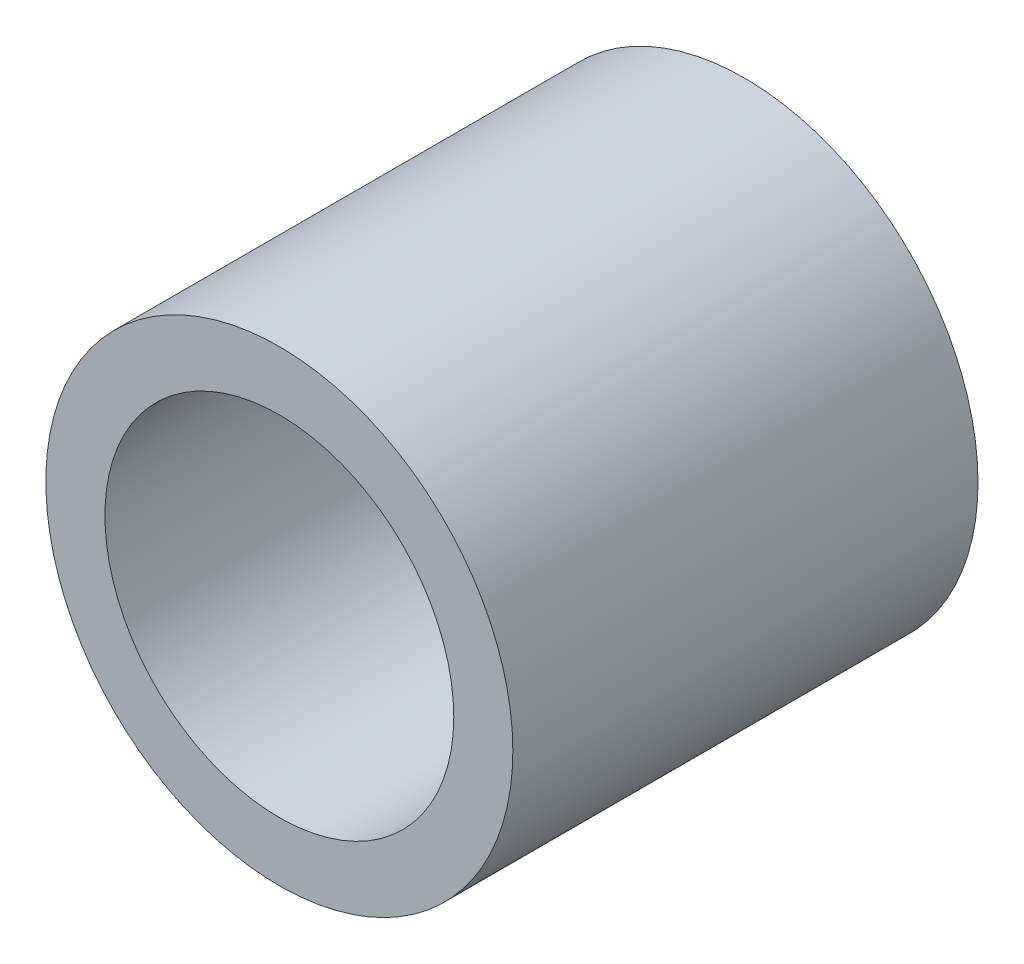
ISO-10303-21;
HEADER;
FILE_DESCRIPTION(('STEP AP214'),'2;1');
FILE_NAME('part.step','',(''),(''),'','','');
FILE_SCHEMA(('AUTOMOTIVE_DESIGN { 1 0 10303 214 1 1 1 1 }'));
ENDSEC;
DATA;
#1=APPLICATION_CONTEXT('core data for automotive mechanical design processes');
#2=APPLICATION_PROTOCOL_DEFINITION('international standard','automotive_design',2000,#1);
#3=PRODUCT_CONTEXT('',#1,'mechanical');
#4=PRODUCT('Part','Part','',(#3));
#5=PRODUCT_RELATED_PRODUCT_CATEGORY('part','',(#4));
#6=PRODUCT_DEFINITION_FORMATION('','',#4);
#7=PRODUCT_DEFINITION_CONTEXT('part definition',#1,'design');
#8=PRODUCT_DEFINITION('design','',#6,#7);
#9=PRODUCT_DEFINITION_SHAPE('','',#8);
#10=(LENGTH_UNIT() NAMED_UNIT(*) SI_UNIT(.MILLI.,.METRE.));
#11=(NAMED_UNIT(*) PLANE_ANGLE_UNIT() SI_UNIT($,.RADIAN.));
#12=(NAMED_UNIT(*) SI_UNIT($,.STERADIAN.) SOLID_ANGLE_UNIT());
#13=UNCERTAINTY_MEASURE_WITH_UNIT(LENGTH_MEASURE(1.E-05),#10,'distance_accuracy_value','');
#14=(GEOMETRIC_REPRESENTATION_CONTEXT(3) GLOBAL_UNCERTAINTY_ASSIGNED_CONTEXT((#13)) GLOBAL_UNIT_ASSIGNED_CONTEXT((#10,
#11,#12)) REPRESENTATION_CONTEXT('',''));
#15=CARTESIAN_POINT('',(0.,0.,0.));
#16=DIRECTION('',(0.,0.,1.));
#17=DIRECTION('',(1.,0.,0.));
#18=AXIS2_PLACEMENT_3D('',#15,#16,#17);
#19=CARTESIAN_POINT('',(0.,0.,3.175));
#20=DIRECTION('',(0.,0.,1.));
#21=DIRECTION('',(1.,0.,0.));
#22=AXIS2_PLACEMENT_3D('',#19,#20,#21);
#23=PLANE('',#22);
#24=CARTESIAN_POINT('',(0.,0.,3.175));
#25=DIRECTION('',(0.,0.,1.));
#26=DIRECTION('',(1.,0.,0.));
#27=AXIS2_PLACEMENT_3D('',#24,#25,#26);
#28=CIRCLE('',#27,3.1877);
#29=CARTESIAN_POINT('',(3.1877,0.,3.175));
#30=VERTEX_POINT('',#29);
#31=EDGE_CURVE('E10',#30,#30,#28,.T.);
#32=ORIENTED_EDGE('',*,*,#31,.T.);
#33=EDGE_LOOP('',(#32));
#34=FACE_BOUND('',#33,.T.);
#35=CARTESIAN_POINT('',(0.,0.,3.175));
#36=DIRECTION('',(0.,0.,1.));
#37=DIRECTION('',(1.,0.,0.));
#38=AXIS2_PLACEMENT_3D('',#35,#36,#37);
#39=CIRCLE('',#38,2.38125);
#40=CARTESIAN_POINT('',(2.38125,0.,3.175));
#41=VERTEX_POINT('',#40);
#42=EDGE_CURVE('E42',#41,#41,#39,.T.);
#43=ORIENTED_EDGE('',*,*,#42,.F.);
#44=EDGE_LOOP('',(#43));
#45=FACE_BOUND('',#44,.T.);
#46=ADVANCED_FACE('F31',(#34,#45),#23,.T.);
#47=CARTESIAN_POINT('',(0.,0.,-3.175));
#48=DIRECTION('',(0.,0.,1.));
#49=DIRECTION('',(1.,0.,0.));
#50=AXIS2_PLACEMENT_3D('',#47,#48,#49);
#51=PLANE('',#50);
#52=CARTESIAN_POINT('',(0.,0.,-3.175));
#53=DIRECTION('',(0.,0.,1.));
#54=DIRECTION('',(1.,0.,0.));
#55=AXIS2_PLACEMENT_3D('',#52,#53,#54);
#56=CIRCLE('',#55,3.1877);
#57=CARTESIAN_POINT('',(3.1877,0.,-3.175));
#58=VERTEX_POINT('',#57);
#59=EDGE_CURVE('E35',#58,#58,#56,.T.);
#60=ORIENTED_EDGE('',*,*,#59,.F.);
#61=EDGE_LOOP('',(#60));
#62=FACE_BOUND('',#61,.T.);
#63=CARTESIAN_POINT('',(0.,0.,-3.175));
#64=DIRECTION('',(0.,0.,1.));
#65=DIRECTION('',(1.,0.,0.));
#66=AXIS2_PLACEMENT_3D('',#63,#64,#65);
#67=CIRCLE('',#66,2.38125);
#68=CARTESIAN_POINT('',(2.38125,0.,-3.175));
#69=VERTEX_POINT('',#68);
#70=EDGE_CURVE('E44',#69,#69,#67,.T.);
#71=ORIENTED_EDGE('',*,*,#70,.T.);
#72=EDGE_LOOP('',(#71));
#73=FACE_BOUND('',#72,.T.);
#74=ADVANCED_FACE('F54',(#62,#73),#51,.F.);
#75=CARTESIAN_POINT('',(0.,0.,3.175));
#76=DIRECTION('',(0.,0.,-1.));
#77=DIRECTION('',(-1.,0.,0.));
#78=AXIS2_PLACEMENT_3D('',#75,#76,#77);
#79=CYLINDRICAL_SURFACE('',#78,3.1877);
#80=ORIENTED_EDGE('',*,*,#31,.F.);
#81=EDGE_LOOP('',(#80));
#82=FACE_BOUND('',#81,.T.);
#83=ORIENTED_EDGE('',*,*,#59,.T.);
#84=EDGE_LOOP('',(#83));
#85=FACE_BOUND('',#84,.T.);
#86=ADVANCED_FACE('F33',(#82,#85),#79,.T.);
#87=CARTESIAN_POINT('',(0.,0.,3.175));
#88=DIRECTION('',(0.,0.,-1.));
#89=DIRECTION('',(-1.,0.,0.));
#90=AXIS2_PLACEMENT_3D('',#87,#88,#89);
#91=CYLINDRICAL_SURFACE('',#90,2.38125);
#92=ORIENTED_EDGE('',*,*,#42,.T.);
#93=EDGE_LOOP('',(#92));
#94=FACE_BOUND('',#93,.T.);
#95=ORIENTED_EDGE('',*,*,#70,.F.);
#96=EDGE_LOOP('',(#95));
#97=FACE_BOUND('',#96,.T.);
#98=ADVANCED_FACE('F50',(#94,#97),#91,.F.);
#99=CLOSED_SHELL('',(#46,#74,#86,#98));
#100=MANIFOLD_SOLID_BREP('B2',#99);
#101=ADVANCED_BREP_SHAPE_REPRESENTATION('',(#18,#100),#14);
#102=SHAPE_DEFINITION_REPRESENTATION(#9,#101);
ENDSEC;
END-ISO-10303-21;
